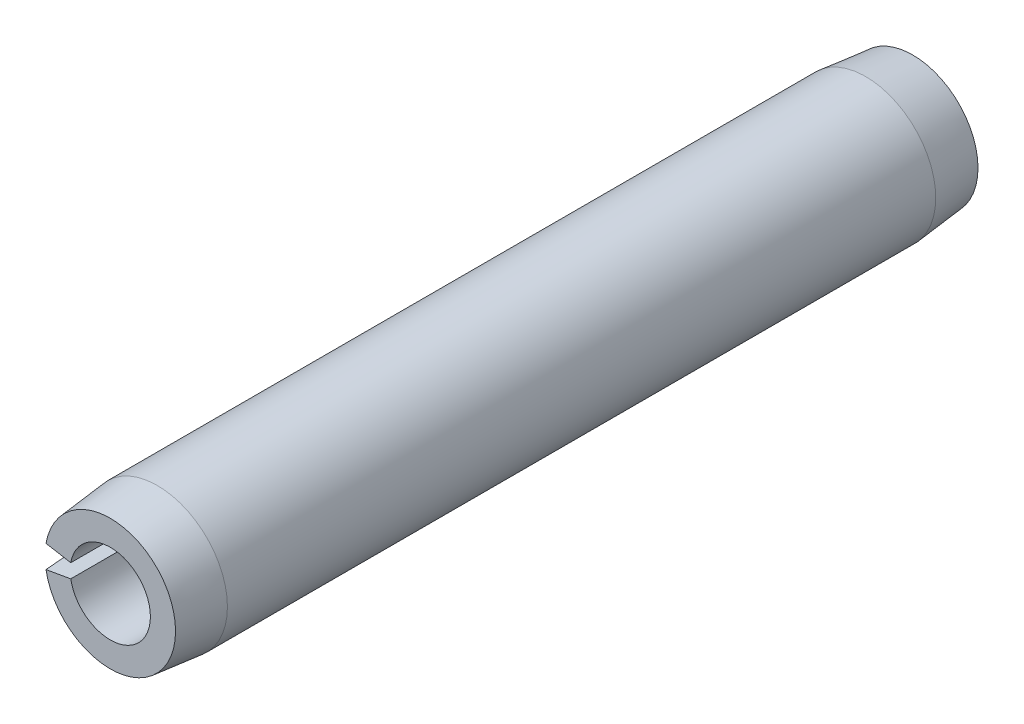
ISO-10303-21;
HEADER;
FILE_DESCRIPTION(('STEP AP214'),'2;1');
FILE_NAME('part.step','',(''),(''),'','','');
FILE_SCHEMA(('AUTOMOTIVE_DESIGN { 1 0 10303 214 1 1 1 1 }'));
ENDSEC;
DATA;
#1=APPLICATION_CONTEXT('core data for automotive mechanical design processes');
#2=APPLICATION_PROTOCOL_DEFINITION('international standard','automotive_design',2000,#1);
#3=PRODUCT_CONTEXT('',#1,'mechanical');
#4=PRODUCT('Part','Part','',(#3));
#5=PRODUCT_RELATED_PRODUCT_CATEGORY('part','',(#4));
#6=PRODUCT_DEFINITION_FORMATION('','',#4);
#7=PRODUCT_DEFINITION_CONTEXT('part definition',#1,'design');
#8=PRODUCT_DEFINITION('design','',#6,#7);
#9=PRODUCT_DEFINITION_SHAPE('','',#8);
#10=(LENGTH_UNIT() NAMED_UNIT(*) SI_UNIT(.MILLI.,.METRE.));
#11=(NAMED_UNIT(*) PLANE_ANGLE_UNIT() SI_UNIT($,.RADIAN.));
#12=(NAMED_UNIT(*) SI_UNIT($,.STERADIAN.) SOLID_ANGLE_UNIT());
#13=UNCERTAINTY_MEASURE_WITH_UNIT(LENGTH_MEASURE(1.E-05),#10,'distance_accuracy_value','');
#14=(GEOMETRIC_REPRESENTATION_CONTEXT(3) GLOBAL_UNCERTAINTY_ASSIGNED_CONTEXT((#13)) GLOBAL_UNIT_ASSIGNED_CONTEXT((#10,
#11,#12)) REPRESENTATION_CONTEXT('',''));
#15=CARTESIAN_POINT('',(0.,0.,0.));
#16=DIRECTION('',(0.,0.,1.));
#17=DIRECTION('',(1.,0.,0.));
#18=AXIS2_PLACEMENT_3D('',#15,#16,#17);
#19=CARTESIAN_POINT('',(0.,0.,9.525));
#20=DIRECTION('',(0.,0.,-1.));
#21=DIRECTION('',(-1.,0.,0.));
#22=AXIS2_PLACEMENT_3D('',#19,#20,#21);
#23=CYLINDRICAL_SURFACE('',#22,0.9525);
#24=CARTESIAN_POINT('',(0.,0.,-9.525));
#25=DIRECTION('',(0.,0.,-1.));
#26=DIRECTION('',(1.,0.,0.));
#27=AXIS2_PLACEMENT_3D('',#24,#25,#26);
#28=CIRCLE('',#27,0.9525);
#29=CARTESIAN_POINT('',(-0.938029384744128,0.165399889227748,-9.525));
#30=VERTEX_POINT('',#29);
#31=CARTESIAN_POINT('',(-0.938029384744128,-0.165399889227748,-9.525));
#32=VERTEX_POINT('',#31);
#33=EDGE_CURVE('E127',#30,#32,#28,.T.);
#34=ORIENTED_EDGE('',*,*,#33,.T.);
#35=DIRECTION('',(0.,0.,-1.));
#36=VECTOR('',#35,1.);
#37=CARTESIAN_POINT('',(-0.938029384744128,-0.165399889227748,9.525));
#38=LINE('',#37,#36);
#39=CARTESIAN_POINT('',(-0.938029384744128,-0.165399889227748,9.525));
#40=VERTEX_POINT('',#39);
#41=EDGE_CURVE('E13',#40,#32,#38,.T.);
#42=ORIENTED_EDGE('',*,*,#41,.F.);
#43=CARTESIAN_POINT('',(0.,0.,9.525));
#44=DIRECTION('',(0.,0.,-1.));
#45=DIRECTION('',(1.,0.,0.));
#46=AXIS2_PLACEMENT_3D('',#43,#44,#45);
#47=CIRCLE('',#46,0.9525);
#48=CARTESIAN_POINT('',(-0.938029384744128,0.165399889227748,9.525));
#49=VERTEX_POINT('',#48);
#50=EDGE_CURVE('E123',#49,#40,#47,.T.);
#51=ORIENTED_EDGE('',*,*,#50,.F.);
#52=DIRECTION('',(0.,0.,-1.));
#53=VECTOR('',#52,1.);
#54=CARTESIAN_POINT('',(-0.938029384744128,0.165399889227748,9.525));
#55=LINE('',#54,#53);
#56=EDGE_CURVE('E116',#49,#30,#55,.T.);
#57=ORIENTED_EDGE('',*,*,#56,.T.);
#58=EDGE_LOOP('',(#34,#42,#51,#57));
#59=FACE_BOUND('',#58,.T.);
#60=ADVANCED_FACE('F44',(#59),#23,.F.);
#61=CARTESIAN_POINT('',(-0.938029384744128,-0.165399889227748,9.525));
#62=DIRECTION('',(0.173648177666927,-0.984807753012209,0.));
#63=DIRECTION('',(0.984807753012209,0.173648177666927,0.));
#64=AXIS2_PLACEMENT_3D('',#61,#62,#63);
#65=PLANE('',#64);
#66=DIRECTION('',(0.,0.,-1.));
#67=VECTOR('',#66,1.);
#68=CARTESIAN_POINT('',(-1.63842465868641,-0.288898473184466,9.525));
#69=LINE('',#68,#67);
#70=CARTESIAN_POINT('',(-1.63842465868641,-0.288898473184467,8.4074));
#71=VERTEX_POINT('',#70);
#72=CARTESIAN_POINT('',(-1.63842465868641,-0.288898473184467,-8.4074));
#73=VERTEX_POINT('',#72);
#74=EDGE_CURVE('E51',#71,#73,#69,.T.);
#75=ORIENTED_EDGE('',*,*,#74,.F.);
#76=DIRECTION('',(-0.100196325582816,-0.0176673155681,-0.99481081734183));
#77=VECTOR('',#76,1.);
#78=CARTESIAN_POINT('',(0.,0.,24.6746888888889));
#79=LINE('',#78,#77);
#80=CARTESIAN_POINT('',(-1.52586113251712,-0.269050486477137,9.525));
#81=VERTEX_POINT('',#80);
#82=EDGE_CURVE('E98',#71,#81,#79,.F.);
#83=ORIENTED_EDGE('',*,*,#82,.T.);
#84=DIRECTION('',(-0.984807753012209,-0.173648177666927,0.));
#85=VECTOR('',#84,1.);
#86=CARTESIAN_POINT('',(-0.938029384744128,-0.165399889227748,9.525));
#87=LINE('',#86,#85);
#88=EDGE_CURVE('E131',#40,#81,#87,.T.);
#89=ORIENTED_EDGE('',*,*,#88,.F.);
#90=ORIENTED_EDGE('',*,*,#41,.T.);
#91=DIRECTION('',(-0.984807753012209,-0.173648177666927,0.));
#92=VECTOR('',#91,1.);
#93=CARTESIAN_POINT('',(-0.938029384744128,-0.165399889227748,-9.525));
#94=LINE('',#93,#92);
#95=CARTESIAN_POINT('',(-1.52586113251712,-0.269050486477138,-9.525));
#96=VERTEX_POINT('',#95);
#97=EDGE_CURVE('E124',#32,#96,#94,.T.);
#98=ORIENTED_EDGE('',*,*,#97,.T.);
#99=DIRECTION('',(0.100196325582816,0.0176673155681,-0.99481081734183));
#100=VECTOR('',#99,1.);
#101=CARTESIAN_POINT('',(0.,0.,-24.6746888888889));
#102=LINE('',#101,#100);
#103=EDGE_CURVE('E66',#96,#73,#102,.F.);
#104=ORIENTED_EDGE('',*,*,#103,.T.);
#105=EDGE_LOOP('',(#75,#83,#89,#90,#98,#104));
#106=FACE_BOUND('',#105,.T.);
#107=ADVANCED_FACE('F145',(#106),#65,.F.);
#108=CARTESIAN_POINT('',(0.,0.,9.525));
#109=DIRECTION('',(0.,0.,-1.));
#110=DIRECTION('',(-1.,0.,0.));
#111=AXIS2_PLACEMENT_3D('',#108,#109,#110);
#112=CYLINDRICAL_SURFACE('',#111,1.6637);
#113=DIRECTION('',(0.,0.,-1.));
#114=VECTOR('',#113,1.);
#115=CARTESIAN_POINT('',(-1.63842465868641,0.288898473184467,9.525));
#116=LINE('',#115,#114);
#117=CARTESIAN_POINT('',(-1.63842465868641,0.288898473184467,8.4074));
#118=VERTEX_POINT('',#117);
#119=CARTESIAN_POINT('',(-1.63842465868641,0.288898473184467,-8.4074));
#120=VERTEX_POINT('',#119);
#121=EDGE_CURVE('E108',#118,#120,#116,.T.);
#122=ORIENTED_EDGE('',*,*,#121,.F.);
#123=CARTESIAN_POINT('',(0.,0.,8.4074));
#124=DIRECTION('',(0.,0.,-1.));
#125=DIRECTION('',(-1.,0.,0.));
#126=AXIS2_PLACEMENT_3D('',#123,#124,#125);
#127=CIRCLE('',#126,1.6637);
#128=EDGE_CURVE('E95',#118,#71,#127,.T.);
#129=ORIENTED_EDGE('',*,*,#128,.T.);
#130=ORIENTED_EDGE('',*,*,#74,.T.);
#131=CARTESIAN_POINT('',(0.,0.,-8.4074));
#132=DIRECTION('',(0.,0.,-1.));
#133=DIRECTION('',(-1.,0.,0.));
#134=AXIS2_PLACEMENT_3D('',#131,#132,#133);
#135=CIRCLE('',#134,1.6637);
#136=EDGE_CURVE('E115',#120,#73,#135,.T.);
#137=ORIENTED_EDGE('',*,*,#136,.F.);
#138=EDGE_LOOP('',(#122,#129,#130,#137));
#139=FACE_BOUND('',#138,.T.);
#140=ADVANCED_FACE('F114',(#139),#112,.T.);
#141=CARTESIAN_POINT('',(-1.63842465868641,0.288898473184467,9.525));
#142=DIRECTION('',(0.173648177666927,0.984807753012209,0.));
#143=DIRECTION('',(-0.984807753012209,0.173648177666927,0.));
#144=AXIS2_PLACEMENT_3D('',#141,#142,#143);
#145=PLANE('',#144);
#146=DIRECTION('',(0.984807753012209,-0.173648177666927,0.));
#147=VECTOR('',#146,1.);
#148=CARTESIAN_POINT('',(-1.63842465868641,0.288898473184467,9.525));
#149=LINE('',#148,#147);
#150=CARTESIAN_POINT('',(-1.52586113251712,0.269050486477137,9.525));
#151=VERTEX_POINT('',#150);
#152=EDGE_CURVE('E111',#151,#49,#149,.T.);
#153=ORIENTED_EDGE('',*,*,#152,.F.);
#154=DIRECTION('',(0.100196325582816,-0.0176673155681,0.99481081734183));
#155=VECTOR('',#154,1.);
#156=CARTESIAN_POINT('',(0.,0.,24.6746888888889));
#157=LINE('',#156,#155);
#158=EDGE_CURVE('E58',#151,#118,#157,.F.);
#159=ORIENTED_EDGE('',*,*,#158,.T.);
#160=ORIENTED_EDGE('',*,*,#121,.T.);
#161=DIRECTION('',(-0.100196325582816,0.0176673155681,0.99481081734183));
#162=VECTOR('',#161,1.);
#163=CARTESIAN_POINT('',(0.,0.,-24.6746888888889));
#164=LINE('',#163,#162);
#165=CARTESIAN_POINT('',(-1.52586113251712,0.269050486477137,-9.525));
#166=VERTEX_POINT('',#165);
#167=EDGE_CURVE('E137',#120,#166,#164,.F.);
#168=ORIENTED_EDGE('',*,*,#167,.T.);
#169=DIRECTION('',(0.984807753012209,-0.173648177666927,0.));
#170=VECTOR('',#169,1.);
#171=CARTESIAN_POINT('',(-1.63842465868641,0.288898473184467,-9.525));
#172=LINE('',#171,#170);
#173=EDGE_CURVE('E121',#166,#30,#172,.T.);
#174=ORIENTED_EDGE('',*,*,#173,.T.);
#175=ORIENTED_EDGE('',*,*,#56,.F.);
#176=EDGE_LOOP('',(#153,#159,#160,#168,#174,#175));
#177=FACE_BOUND('',#176,.T.);
#178=ADVANCED_FACE('F106',(#177),#145,.F.);
#179=CARTESIAN_POINT('',(0.,0.,9.525));
#180=DIRECTION('',(0.,0.,1.));
#181=DIRECTION('',(1.,0.,0.));
#182=AXIS2_PLACEMENT_3D('',#179,#180,#181);
#183=PLANE('',#182);
#184=CARTESIAN_POINT('',(0.,0.,9.525));
#185=DIRECTION('',(0.,0.,-1.));
#186=DIRECTION('',(-1.,0.,0.));
#187=AXIS2_PLACEMENT_3D('',#184,#185,#186);
#188=CIRCLE('',#187,1.5494);
#189=EDGE_CURVE('E102',#151,#81,#188,.T.);
#190=ORIENTED_EDGE('',*,*,#189,.F.);
#191=ORIENTED_EDGE('',*,*,#152,.T.);
#192=ORIENTED_EDGE('',*,*,#50,.T.);
#193=ORIENTED_EDGE('',*,*,#88,.T.);
#194=EDGE_LOOP('',(#190,#191,#192,#193));
#195=FACE_BOUND('',#194,.T.);
#196=ADVANCED_FACE('F146',(#195),#183,.T.);
#197=CARTESIAN_POINT('',(0.,0.,-9.525));
#198=DIRECTION('',(0.,0.,1.));
#199=DIRECTION('',(1.,0.,0.));
#200=AXIS2_PLACEMENT_3D('',#197,#198,#199);
#201=PLANE('',#200);
#202=ORIENTED_EDGE('',*,*,#173,.F.);
#203=CARTESIAN_POINT('',(0.,0.,-9.525));
#204=DIRECTION('',(0.,0.,-1.));
#205=DIRECTION('',(-1.,0.,0.));
#206=AXIS2_PLACEMENT_3D('',#203,#204,#205);
#207=CIRCLE('',#206,1.5494);
#208=EDGE_CURVE('E139',#166,#96,#207,.T.);
#209=ORIENTED_EDGE('',*,*,#208,.T.);
#210=ORIENTED_EDGE('',*,*,#97,.F.);
#211=ORIENTED_EDGE('',*,*,#33,.F.);
#212=EDGE_LOOP('',(#202,#209,#210,#211));
#213=FACE_BOUND('',#212,.T.);
#214=ADVANCED_FACE('F153',(#213),#201,.F.);
#215=CARTESIAN_POINT('',(0.,0.,-8.4074));
#216=DIRECTION('',(0.,0.,1.));
#217=DIRECTION('',(1.,0.,0.));
#218=AXIS2_PLACEMENT_3D('',#215,#216,#217);
#219=CONICAL_SURFACE('',#218,1.6637,0.101918367480874);
#220=ORIENTED_EDGE('',*,*,#208,.F.);
#221=ORIENTED_EDGE('',*,*,#167,.F.);
#222=ORIENTED_EDGE('',*,*,#136,.T.);
#223=ORIENTED_EDGE('',*,*,#103,.F.);
#224=EDGE_LOOP('',(#220,#221,#222,#223));
#225=FACE_BOUND('',#224,.T.);
#226=ADVANCED_FACE('F154',(#225),#219,.T.);
#227=CARTESIAN_POINT('',(0.,0.,9.525));
#228=DIRECTION('',(0.,0.,-1.));
#229=DIRECTION('',(-1.,0.,0.));
#230=AXIS2_PLACEMENT_3D('',#227,#228,#229);
#231=CONICAL_SURFACE('',#230,1.5494,0.101918367480874);
#232=ORIENTED_EDGE('',*,*,#128,.F.);
#233=ORIENTED_EDGE('',*,*,#158,.F.);
#234=ORIENTED_EDGE('',*,*,#189,.T.);
#235=ORIENTED_EDGE('',*,*,#82,.F.);
#236=EDGE_LOOP('',(#232,#233,#234,#235));
#237=FACE_BOUND('',#236,.T.);
#238=ADVANCED_FACE('F96',(#237),#231,.T.);
#239=CLOSED_SHELL('',(#60,#107,#140,#178,#196,#214,#226,#238));
#240=MANIFOLD_SOLID_BREP('B2',#239);
#241=ADVANCED_BREP_SHAPE_REPRESENTATION('',(#18,#240),#14);
#242=SHAPE_DEFINITION_REPRESENTATION(#9,#241);
ENDSEC;
END-ISO-10303-21;
